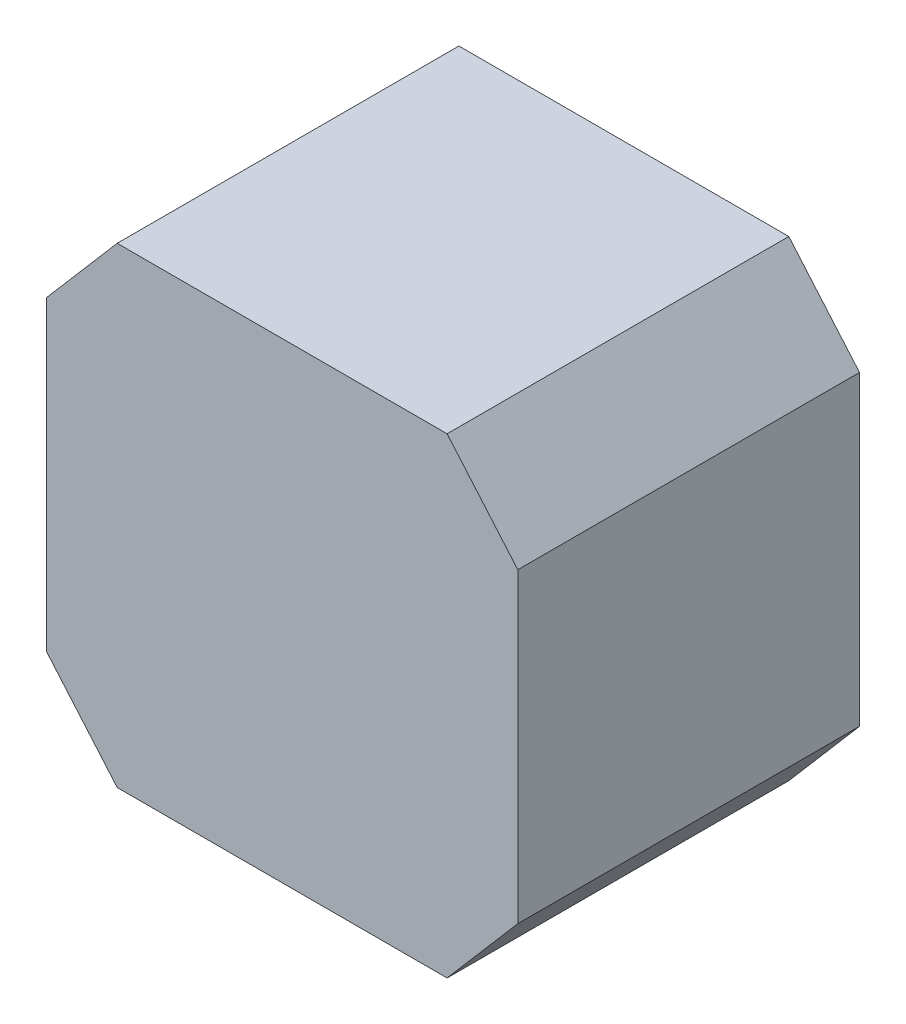
ISO-10303-21;
HEADER;
FILE_DESCRIPTION(('STEP AP214'),'2;1');
FILE_NAME('part.step','',(''),(''),'','','');
FILE_SCHEMA(('AUTOMOTIVE_DESIGN { 1 0 10303 214 1 1 1 1 }'));
ENDSEC;
DATA;
#1=APPLICATION_CONTEXT('core data for automotive mechanical design processes');
#2=APPLICATION_PROTOCOL_DEFINITION('international standard','automotive_design',2000,#1);
#3=PRODUCT_CONTEXT('',#1,'mechanical');
#4=PRODUCT('Part','Part','',(#3));
#5=PRODUCT_RELATED_PRODUCT_CATEGORY('part','',(#4));
#6=PRODUCT_DEFINITION_FORMATION('','',#4);
#7=PRODUCT_DEFINITION_CONTEXT('part definition',#1,'design');
#8=PRODUCT_DEFINITION('design','',#6,#7);
#9=PRODUCT_DEFINITION_SHAPE('','',#8);
#10=(LENGTH_UNIT() NAMED_UNIT(*) SI_UNIT(.MILLI.,.METRE.));
#11=(NAMED_UNIT(*) PLANE_ANGLE_UNIT() SI_UNIT($,.RADIAN.));
#12=(NAMED_UNIT(*) SI_UNIT($,.STERADIAN.) SOLID_ANGLE_UNIT());
#13=UNCERTAINTY_MEASURE_WITH_UNIT(LENGTH_MEASURE(1.E-05),#10,'distance_accuracy_value','');
#14=(GEOMETRIC_REPRESENTATION_CONTEXT(3) GLOBAL_UNCERTAINTY_ASSIGNED_CONTEXT((#13)) GLOBAL_UNIT_ASSIGNED_CONTEXT((#10,
#11,#12)) REPRESENTATION_CONTEXT('',''));
#15=CARTESIAN_POINT('',(0.,0.,0.));
#16=DIRECTION('',(0.,0.,1.));
#17=DIRECTION('',(1.,0.,0.));
#18=AXIS2_PLACEMENT_3D('',#15,#16,#17);
#19=CARTESIAN_POINT('',(-14.,20.3225806451613,29.));
#20=DIRECTION('',(0.759029799990086,-0.651055882952463,0.));
#21=DIRECTION('',(0.651055882952463,0.759029799990086,0.));
#22=AXIS2_PLACEMENT_3D('',#19,#20,#21);
#23=PLANE('',#22);
#24=DIRECTION('',(-0.651055882952463,-0.759029799990086,0.));
#25=VECTOR('',#24,1.);
#26=CARTESIAN_POINT('',(-14.,20.3225806451613,0.));
#27=LINE('',#26,#25);
#28=CARTESIAN_POINT('',(-14.,20.3225806451613,0.));
#29=VERTEX_POINT('',#28);
#30=CARTESIAN_POINT('',(-20.0000000000752,13.3275147541276,0.));
#31=VERTEX_POINT('',#30);
#32=EDGE_CURVE('E128',#29,#31,#27,.T.);
#33=ORIENTED_EDGE('',*,*,#32,.T.);
#34=DIRECTION('',(0.,0.,-1.));
#35=VECTOR('',#34,1.);
#36=CARTESIAN_POINT('',(-20.0000000000752,13.3275147541276,29.));
#37=LINE('',#36,#35);
#38=CARTESIAN_POINT('',(-20.0000000000752,13.3275147541276,29.));
#39=VERTEX_POINT('',#38);
#40=EDGE_CURVE('E11',#39,#31,#37,.T.);
#41=ORIENTED_EDGE('',*,*,#40,.F.);
#42=DIRECTION('',(-0.651055882952463,-0.759029799990086,0.));
#43=VECTOR('',#42,1.);
#44=CARTESIAN_POINT('',(-14.,20.3225806451613,29.));
#45=LINE('',#44,#43);
#46=CARTESIAN_POINT('',(-14.,20.3225806451613,29.));
#47=VERTEX_POINT('',#46);
#48=EDGE_CURVE('E147',#47,#39,#45,.T.);
#49=ORIENTED_EDGE('',*,*,#48,.F.);
#50=DIRECTION('',(0.,0.,-1.));
#51=VECTOR('',#50,1.);
#52=CARTESIAN_POINT('',(-14.,20.3225806451613,29.));
#53=LINE('',#52,#51);
#54=EDGE_CURVE('E48',#47,#29,#53,.T.);
#55=ORIENTED_EDGE('',*,*,#54,.T.);
#56=EDGE_LOOP('',(#33,#41,#49,#55));
#57=FACE_BOUND('',#56,.T.);
#58=ADVANCED_FACE('F32',(#57),#23,.F.);
#59=CARTESIAN_POINT('',(-20.0000000000752,13.3275147541276,29.));
#60=DIRECTION('',(1.,0.,0.));
#61=DIRECTION('',(0.,0.,-1.));
#62=AXIS2_PLACEMENT_3D('',#59,#60,#61);
#63=PLANE('',#62);
#64=DIRECTION('',(0.,-1.,0.));
#65=VECTOR('',#64,1.);
#66=CARTESIAN_POINT('',(-20.0000000000752,13.3275147541276,0.));
#67=LINE('',#66,#65);
#68=CARTESIAN_POINT('',(-20.0000000000752,-12.682353463805,0.));
#69=VERTEX_POINT('',#68);
#70=EDGE_CURVE('E130',#31,#69,#67,.T.);
#71=ORIENTED_EDGE('',*,*,#70,.T.);
#72=DIRECTION('',(0.,0.,-1.));
#73=VECTOR('',#72,1.);
#74=CARTESIAN_POINT('',(-20.0000000000752,-12.682353463805,29.));
#75=LINE('',#74,#73);
#76=CARTESIAN_POINT('',(-20.0000000000752,-12.682353463805,29.));
#77=VERTEX_POINT('',#76);
#78=EDGE_CURVE('E40',#77,#69,#75,.T.);
#79=ORIENTED_EDGE('',*,*,#78,.F.);
#80=DIRECTION('',(0.,-1.,0.));
#81=VECTOR('',#80,1.);
#82=CARTESIAN_POINT('',(-20.0000000000752,13.3275147541276,29.));
#83=LINE('',#82,#81);
#84=EDGE_CURVE('E86',#39,#77,#83,.T.);
#85=ORIENTED_EDGE('',*,*,#84,.F.);
#86=ORIENTED_EDGE('',*,*,#40,.T.);
#87=EDGE_LOOP('',(#71,#79,#85,#86));
#88=FACE_BOUND('',#87,.T.);
#89=ADVANCED_FACE('F161',(#88),#63,.F.);
#90=CARTESIAN_POINT('',(-14.,-19.6774193548387,29.));
#91=DIRECTION('',(-0.759029799990086,-0.651055882952463,0.));
#92=DIRECTION('',(0.651055882952463,-0.759029799990086,0.));
#93=AXIS2_PLACEMENT_3D('',#90,#91,#92);
#94=PLANE('',#93);
#95=DIRECTION('',(-0.651055882952463,0.759029799990086,0.));
#96=VECTOR('',#95,1.);
#97=CARTESIAN_POINT('',(-14.,-19.6774193548387,0.));
#98=LINE('',#97,#96);
#99=CARTESIAN_POINT('',(-14.,-19.6774193548387,0.));
#100=VERTEX_POINT('',#99);
#101=EDGE_CURVE('E133',#100,#69,#98,.T.);
#102=ORIENTED_EDGE('',*,*,#101,.F.);
#103=DIRECTION('',(0.,0.,-1.));
#104=VECTOR('',#103,1.);
#105=CARTESIAN_POINT('',(-14.,-19.6774193548387,29.));
#106=LINE('',#105,#104);
#107=CARTESIAN_POINT('',(-14.,-19.6774193548387,29.));
#108=VERTEX_POINT('',#107);
#109=EDGE_CURVE('E154',#108,#100,#106,.T.);
#110=ORIENTED_EDGE('',*,*,#109,.F.);
#111=DIRECTION('',(-0.651055882952463,0.759029799990086,0.));
#112=VECTOR('',#111,1.);
#113=CARTESIAN_POINT('',(-14.,-19.6774193548387,29.));
#114=LINE('',#113,#112);
#115=EDGE_CURVE('E160',#108,#77,#114,.T.);
#116=ORIENTED_EDGE('',*,*,#115,.T.);
#117=ORIENTED_EDGE('',*,*,#78,.T.);
#118=EDGE_LOOP('',(#102,#110,#116,#117));
#119=FACE_BOUND('',#118,.T.);
#120=ADVANCED_FACE('F158',(#119),#94,.T.);
#121=CARTESIAN_POINT('',(-14.,-19.6774193548387,29.));
#122=DIRECTION('',(0.,1.,0.));
#123=DIRECTION('',(0.,0.,1.));
#124=AXIS2_PLACEMENT_3D('',#121,#122,#123);
#125=PLANE('',#124);
#126=DIRECTION('',(1.,0.,0.));
#127=VECTOR('',#126,1.);
#128=CARTESIAN_POINT('',(-14.,-19.6774193548387,0.));
#129=LINE('',#128,#127);
#130=CARTESIAN_POINT('',(14.,-19.6774193548387,0.));
#131=VERTEX_POINT('',#130);
#132=EDGE_CURVE('E136',#100,#131,#129,.T.);
#133=ORIENTED_EDGE('',*,*,#132,.T.);
#134=DIRECTION('',(0.,0.,-1.));
#135=VECTOR('',#134,1.);
#136=CARTESIAN_POINT('',(14.,-19.6774193548387,29.));
#137=LINE('',#136,#135);
#138=CARTESIAN_POINT('',(14.,-19.6774193548387,29.));
#139=VERTEX_POINT('',#138);
#140=EDGE_CURVE('E151',#139,#131,#137,.T.);
#141=ORIENTED_EDGE('',*,*,#140,.F.);
#142=DIRECTION('',(1.,0.,0.));
#143=VECTOR('',#142,1.);
#144=CARTESIAN_POINT('',(-14.,-19.6774193548387,29.));
#145=LINE('',#144,#143);
#146=EDGE_CURVE('E173',#108,#139,#145,.T.);
#147=ORIENTED_EDGE('',*,*,#146,.F.);
#148=ORIENTED_EDGE('',*,*,#109,.T.);
#149=EDGE_LOOP('',(#133,#141,#147,#148));
#150=FACE_BOUND('',#149,.T.);
#151=ADVANCED_FACE('F169',(#150),#125,.F.);
#152=CARTESIAN_POINT('',(14.,-19.6774193548387,29.));
#153=DIRECTION('',(-0.759029799990086,0.651055882952463,0.));
#154=DIRECTION('',(-0.651055882952463,-0.759029799990086,0.));
#155=AXIS2_PLACEMENT_3D('',#152,#153,#154);
#156=PLANE('',#155);
#157=DIRECTION('',(0.651055882952463,0.759029799990086,0.));
#158=VECTOR('',#157,1.);
#159=CARTESIAN_POINT('',(14.,-19.6774193548387,0.));
#160=LINE('',#159,#158);
#161=CARTESIAN_POINT('',(20.0000000000752,-12.682353463805,0.));
#162=VERTEX_POINT('',#161);
#163=EDGE_CURVE('E138',#131,#162,#160,.T.);
#164=ORIENTED_EDGE('',*,*,#163,.T.);
#165=DIRECTION('',(0.,0.,-1.));
#166=VECTOR('',#165,1.);
#167=CARTESIAN_POINT('',(20.0000000000752,-12.682353463805,29.));
#168=LINE('',#167,#166);
#169=CARTESIAN_POINT('',(20.0000000000752,-12.682353463805,29.));
#170=VERTEX_POINT('',#169);
#171=EDGE_CURVE('E111',#170,#162,#168,.T.);
#172=ORIENTED_EDGE('',*,*,#171,.F.);
#173=DIRECTION('',(0.651055882952463,0.759029799990086,0.));
#174=VECTOR('',#173,1.);
#175=CARTESIAN_POINT('',(14.,-19.6774193548387,29.));
#176=LINE('',#175,#174);
#177=EDGE_CURVE('E119',#139,#170,#176,.T.);
#178=ORIENTED_EDGE('',*,*,#177,.F.);
#179=ORIENTED_EDGE('',*,*,#140,.T.);
#180=EDGE_LOOP('',(#164,#172,#178,#179));
#181=FACE_BOUND('',#180,.T.);
#182=ADVANCED_FACE('F172',(#181),#156,.F.);
#183=CARTESIAN_POINT('',(20.0000000000752,13.3275147541276,29.));
#184=DIRECTION('',(1.,0.,0.));
#185=DIRECTION('',(0.,0.,-1.));
#186=AXIS2_PLACEMENT_3D('',#183,#184,#185);
#187=PLANE('',#186);
#188=DIRECTION('',(0.,-1.,0.));
#189=VECTOR('',#188,1.);
#190=CARTESIAN_POINT('',(20.0000000000752,13.3275147541276,0.));
#191=LINE('',#190,#189);
#192=CARTESIAN_POINT('',(20.0000000000752,13.3275147541276,0.));
#193=VERTEX_POINT('',#192);
#194=EDGE_CURVE('E107',#193,#162,#191,.T.);
#195=ORIENTED_EDGE('',*,*,#194,.F.);
#196=DIRECTION('',(0.,0.,-1.));
#197=VECTOR('',#196,1.);
#198=CARTESIAN_POINT('',(20.0000000000752,13.3275147541276,29.));
#199=LINE('',#198,#197);
#200=CARTESIAN_POINT('',(20.0000000000752,13.3275147541276,29.));
#201=VERTEX_POINT('',#200);
#202=EDGE_CURVE('E102',#201,#193,#199,.T.);
#203=ORIENTED_EDGE('',*,*,#202,.F.);
#204=DIRECTION('',(0.,-1.,0.));
#205=VECTOR('',#204,1.);
#206=CARTESIAN_POINT('',(20.0000000000752,13.3275147541276,29.));
#207=LINE('',#206,#205);
#208=EDGE_CURVE('E105',#201,#170,#207,.T.);
#209=ORIENTED_EDGE('',*,*,#208,.T.);
#210=ORIENTED_EDGE('',*,*,#171,.T.);
#211=EDGE_LOOP('',(#195,#203,#209,#210));
#212=FACE_BOUND('',#211,.T.);
#213=ADVANCED_FACE('F104',(#212),#187,.T.);
#214=CARTESIAN_POINT('',(14.,20.3225806451613,29.));
#215=DIRECTION('',(0.759029799990086,0.651055882952463,0.));
#216=DIRECTION('',(-0.651055882952463,0.759029799990086,0.));
#217=AXIS2_PLACEMENT_3D('',#214,#215,#216);
#218=PLANE('',#217);
#219=DIRECTION('',(0.651055882952463,-0.759029799990086,0.));
#220=VECTOR('',#219,1.);
#221=CARTESIAN_POINT('',(14.,20.3225806451613,0.));
#222=LINE('',#221,#220);
#223=CARTESIAN_POINT('',(14.,20.3225806451613,0.));
#224=VERTEX_POINT('',#223);
#225=EDGE_CURVE('E142',#224,#193,#222,.T.);
#226=ORIENTED_EDGE('',*,*,#225,.F.);
#227=DIRECTION('',(0.,0.,-1.));
#228=VECTOR('',#227,1.);
#229=CARTESIAN_POINT('',(14.,20.3225806451613,29.));
#230=LINE('',#229,#228);
#231=CARTESIAN_POINT('',(14.,20.3225806451613,29.));
#232=VERTEX_POINT('',#231);
#233=EDGE_CURVE('E74',#232,#224,#230,.T.);
#234=ORIENTED_EDGE('',*,*,#233,.F.);
#235=DIRECTION('',(0.651055882952463,-0.759029799990086,0.));
#236=VECTOR('',#235,1.);
#237=CARTESIAN_POINT('',(14.,20.3225806451613,29.));
#238=LINE('',#237,#236);
#239=EDGE_CURVE('E117',#232,#201,#238,.T.);
#240=ORIENTED_EDGE('',*,*,#239,.T.);
#241=ORIENTED_EDGE('',*,*,#202,.T.);
#242=EDGE_LOOP('',(#226,#234,#240,#241));
#243=FACE_BOUND('',#242,.T.);
#244=ADVANCED_FACE('F122',(#243),#218,.T.);
#245=CARTESIAN_POINT('',(-14.,20.3225806451613,29.));
#246=DIRECTION('',(0.,1.,0.));
#247=DIRECTION('',(0.,0.,1.));
#248=AXIS2_PLACEMENT_3D('',#245,#246,#247);
#249=PLANE('',#248);
#250=DIRECTION('',(1.,0.,0.));
#251=VECTOR('',#250,1.);
#252=CARTESIAN_POINT('',(-14.,20.3225806451613,0.));
#253=LINE('',#252,#251);
#254=EDGE_CURVE('E144',#29,#224,#253,.T.);
#255=ORIENTED_EDGE('',*,*,#254,.F.);
#256=ORIENTED_EDGE('',*,*,#54,.F.);
#257=DIRECTION('',(1.,0.,0.));
#258=VECTOR('',#257,1.);
#259=CARTESIAN_POINT('',(-14.,20.3225806451613,29.));
#260=LINE('',#259,#258);
#261=EDGE_CURVE('E123',#47,#232,#260,.T.);
#262=ORIENTED_EDGE('',*,*,#261,.T.);
#263=ORIENTED_EDGE('',*,*,#233,.T.);
#264=EDGE_LOOP('',(#255,#256,#262,#263));
#265=FACE_BOUND('',#264,.T.);
#266=ADVANCED_FACE('F178',(#265),#249,.T.);
#267=CARTESIAN_POINT('',(0.,0.,29.));
#268=DIRECTION('',(0.,0.,-1.));
#269=DIRECTION('',(-1.,0.,0.));
#270=AXIS2_PLACEMENT_3D('',#267,#268,#269);
#271=PLANE('',#270);
#272=ORIENTED_EDGE('',*,*,#48,.T.);
#273=ORIENTED_EDGE('',*,*,#84,.T.);
#274=ORIENTED_EDGE('',*,*,#115,.F.);
#275=ORIENTED_EDGE('',*,*,#146,.T.);
#276=ORIENTED_EDGE('',*,*,#177,.T.);
#277=ORIENTED_EDGE('',*,*,#208,.F.);
#278=ORIENTED_EDGE('',*,*,#239,.F.);
#279=ORIENTED_EDGE('',*,*,#261,.F.);
#280=EDGE_LOOP('',(#272,#273,#274,#275,#276,#277,#278,#279));
#281=FACE_BOUND('',#280,.T.);
#282=ADVANCED_FACE('F115',(#281),#271,.F.);
#283=CARTESIAN_POINT('',(0.,0.,0.));
#284=DIRECTION('',(0.,0.,-1.));
#285=DIRECTION('',(-1.,0.,0.));
#286=AXIS2_PLACEMENT_3D('',#283,#284,#285);
#287=PLANE('',#286);
#288=ORIENTED_EDGE('',*,*,#32,.F.);
#289=ORIENTED_EDGE('',*,*,#254,.T.);
#290=ORIENTED_EDGE('',*,*,#225,.T.);
#291=ORIENTED_EDGE('',*,*,#194,.T.);
#292=ORIENTED_EDGE('',*,*,#163,.F.);
#293=ORIENTED_EDGE('',*,*,#132,.F.);
#294=ORIENTED_EDGE('',*,*,#101,.T.);
#295=ORIENTED_EDGE('',*,*,#70,.F.);
#296=EDGE_LOOP('',(#288,#289,#290,#291,#292,#293,#294,#295));
#297=FACE_BOUND('',#296,.T.);
#298=ADVANCED_FACE('F165',(#297),#287,.T.);
#299=CLOSED_SHELL('',(#58,#89,#120,#151,#182,#213,#244,#266,#282,#298));
#300=MANIFOLD_SOLID_BREP('B2',#299);
#301=ADVANCED_BREP_SHAPE_REPRESENTATION('',(#18,#300),#14);
#302=SHAPE_DEFINITION_REPRESENTATION(#9,#301);
ENDSEC;
END-ISO-10303-21;
